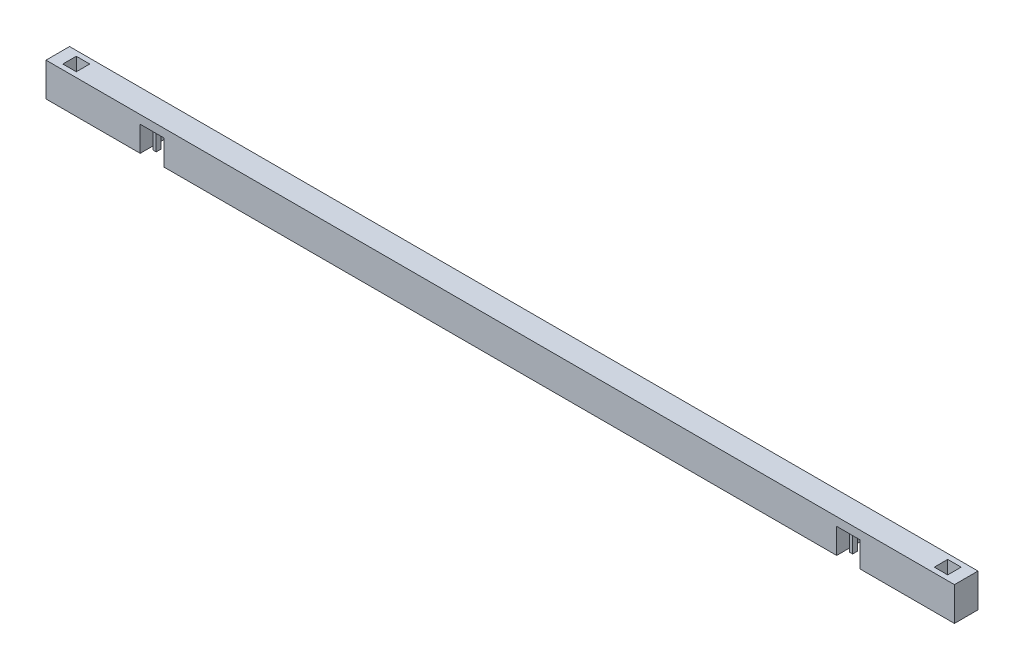
ISO-10303-21;
HEADER;
FILE_DESCRIPTION(('STEP AP214'),'2;1');
FILE_NAME('part.step','',(''),(''),'','','');
FILE_SCHEMA(('AUTOMOTIVE_DESIGN { 1 0 10303 214 1 1 1 1 }'));
ENDSEC;
DATA;
#1=APPLICATION_CONTEXT('core data for automotive mechanical design processes');
#2=APPLICATION_PROTOCOL_DEFINITION('international standard','automotive_design',2000,#1);
#3=PRODUCT_CONTEXT('',#1,'mechanical');
#4=PRODUCT('Part','Part','',(#3));
#5=PRODUCT_RELATED_PRODUCT_CATEGORY('part','',(#4));
#6=PRODUCT_DEFINITION_FORMATION('','',#4);
#7=PRODUCT_DEFINITION_CONTEXT('part definition',#1,'design');
#8=PRODUCT_DEFINITION('design','',#6,#7);
#9=PRODUCT_DEFINITION_SHAPE('','',#8);
#10=(LENGTH_UNIT() NAMED_UNIT(*) SI_UNIT(.MILLI.,.METRE.));
#11=(NAMED_UNIT(*) PLANE_ANGLE_UNIT() SI_UNIT($,.RADIAN.));
#12=(NAMED_UNIT(*) SI_UNIT($,.STERADIAN.) SOLID_ANGLE_UNIT());
#13=UNCERTAINTY_MEASURE_WITH_UNIT(LENGTH_MEASURE(1.E-05),#10,'distance_accuracy_value','');
#14=(GEOMETRIC_REPRESENTATION_CONTEXT(3) GLOBAL_UNCERTAINTY_ASSIGNED_CONTEXT((#13)) GLOBAL_UNIT_ASSIGNED_CONTEXT((#10,
#11,#12)) REPRESENTATION_CONTEXT('',''));
#15=CARTESIAN_POINT('',(0.,0.,0.));
#16=DIRECTION('',(0.,0.,1.));
#17=DIRECTION('',(1.,0.,0.));
#18=AXIS2_PLACEMENT_3D('',#15,#16,#17);
#19=CARTESIAN_POINT('',(0.,200.,0.));
#20=DIRECTION('',(0.,-1.,0.));
#21=DIRECTION('',(0.,0.,-1.));
#22=AXIS2_PLACEMENT_3D('',#19,#20,#21);
#23=PLANE('',#22);
#24=DIRECTION('',(0.,0.,1.));
#25=VECTOR('',#24,1.);
#26=CARTESIAN_POINT('',(0.,200.,0.));
#27=LINE('',#26,#25);
#28=CARTESIAN_POINT('',(0.,200.,-140.));
#29=VERTEX_POINT('',#28);
#30=CARTESIAN_POINT('',(0.,200.,0.));
#31=VERTEX_POINT('',#30);
#32=EDGE_CURVE('E516',#29,#31,#27,.T.);
#33=ORIENTED_EDGE('',*,*,#32,.T.);
#34=DIRECTION('',(1.,0.,0.));
#35=VECTOR('',#34,1.);
#36=CARTESIAN_POINT('',(0.,200.,0.));
#37=LINE('',#36,#35);
#38=CARTESIAN_POINT('',(5400.,200.,0.));
#39=VERTEX_POINT('',#38);
#40=EDGE_CURVE('E519',#31,#39,#37,.T.);
#41=ORIENTED_EDGE('',*,*,#40,.T.);
#42=DIRECTION('',(0.,0.,-1.));
#43=VECTOR('',#42,1.);
#44=CARTESIAN_POINT('',(5400.,200.,0.));
#45=LINE('',#44,#43);
#46=CARTESIAN_POINT('',(5400.,200.,-140.));
#47=VERTEX_POINT('',#46);
#48=EDGE_CURVE('E522',#39,#47,#45,.T.);
#49=ORIENTED_EDGE('',*,*,#48,.T.);
#50=DIRECTION('',(-1.,0.,0.));
#51=VECTOR('',#50,1.);
#52=CARTESIAN_POINT('',(0.,200.,-140.));
#53=LINE('',#52,#51);
#54=EDGE_CURVE('E524',#47,#29,#53,.T.);
#55=ORIENTED_EDGE('',*,*,#54,.T.);
#56=EDGE_LOOP('',(#33,#41,#49,#55));
#57=FACE_BOUND('',#56,.T.);
#58=DIRECTION('',(-1.,0.,0.));
#59=VECTOR('',#58,1.);
#60=CARTESIAN_POINT('',(5330.,200.,-110.));
#61=LINE('',#60,#59);
#62=CARTESIAN_POINT('',(5330.,200.,-110.));
#63=VERTEX_POINT('',#62);
#64=CARTESIAN_POINT('',(5250.,200.,-110.));
#65=VERTEX_POINT('',#64);
#66=EDGE_CURVE('E322',#63,#65,#61,.T.);
#67=ORIENTED_EDGE('',*,*,#66,.F.);
#68=DIRECTION('',(0.,0.,-1.));
#69=VECTOR('',#68,1.);
#70=CARTESIAN_POINT('',(5330.,200.,-110.));
#71=LINE('',#70,#69);
#72=CARTESIAN_POINT('',(5330.,200.,-30.));
#73=VERTEX_POINT('',#72);
#74=EDGE_CURVE('E59',#73,#63,#71,.T.);
#75=ORIENTED_EDGE('',*,*,#74,.F.);
#76=DIRECTION('',(1.,0.,0.));
#77=VECTOR('',#76,1.);
#78=CARTESIAN_POINT('',(5330.,200.,-30.));
#79=LINE('',#78,#77);
#80=CARTESIAN_POINT('',(5250.,200.,-30.));
#81=VERTEX_POINT('',#80);
#82=EDGE_CURVE('E311',#81,#73,#79,.T.);
#83=ORIENTED_EDGE('',*,*,#82,.F.);
#84=DIRECTION('',(0.,0.,1.));
#85=VECTOR('',#84,1.);
#86=CARTESIAN_POINT('',(5250.,200.,-110.));
#87=LINE('',#86,#85);
#88=EDGE_CURVE('E325',#65,#81,#87,.T.);
#89=ORIENTED_EDGE('',*,*,#88,.F.);
#90=EDGE_LOOP('',(#67,#75,#83,#89));
#91=FACE_BOUND('',#90,.T.);
#92=DIRECTION('',(0.,0.,-1.));
#93=VECTOR('',#92,1.);
#94=CARTESIAN_POINT('',(70.0000000000003,200.,-110.));
#95=LINE('',#94,#93);
#96=CARTESIAN_POINT('',(70.0000000000003,200.,-30.));
#97=VERTEX_POINT('',#96);
#98=CARTESIAN_POINT('',(70.0000000000003,200.,-110.));
#99=VERTEX_POINT('',#98);
#100=EDGE_CURVE('E51',#97,#99,#95,.T.);
#101=ORIENTED_EDGE('',*,*,#100,.T.);
#102=DIRECTION('',(1.,0.,0.));
#103=VECTOR('',#102,1.);
#104=CARTESIAN_POINT('',(70.0000000000003,200.,-110.));
#105=LINE('',#104,#103);
#106=CARTESIAN_POINT('',(150.,200.,-110.));
#107=VERTEX_POINT('',#106);
#108=EDGE_CURVE('E289',#99,#107,#105,.T.);
#109=ORIENTED_EDGE('',*,*,#108,.T.);
#110=DIRECTION('',(0.,0.,1.));
#111=VECTOR('',#110,1.);
#112=CARTESIAN_POINT('',(150.,200.,-110.));
#113=LINE('',#112,#111);
#114=CARTESIAN_POINT('',(150.,200.,-30.));
#115=VERTEX_POINT('',#114);
#116=EDGE_CURVE('E292',#107,#115,#113,.T.);
#117=ORIENTED_EDGE('',*,*,#116,.T.);
#118=DIRECTION('',(-1.,0.,0.));
#119=VECTOR('',#118,1.);
#120=CARTESIAN_POINT('',(70.0000000000003,200.,-30.));
#121=LINE('',#120,#119);
#122=EDGE_CURVE('E298',#115,#97,#121,.T.);
#123=ORIENTED_EDGE('',*,*,#122,.T.);
#124=EDGE_LOOP('',(#101,#109,#117,#123));
#125=FACE_BOUND('',#124,.T.);
#126=ADVANCED_FACE('F36',(#57,#91,#125),#23,.F.);
#127=CARTESIAN_POINT('',(0.,0.,0.));
#128=DIRECTION('',(0.,-1.,0.));
#129=DIRECTION('',(0.,0.,-1.));
#130=AXIS2_PLACEMENT_3D('',#127,#128,#129);
#131=PLANE('',#130);
#132=DIRECTION('',(0.,0.,-1.));
#133=VECTOR('',#132,1.);
#134=CARTESIAN_POINT('',(4700.,0.,-140.));
#135=LINE('',#134,#133);
#136=CARTESIAN_POINT('',(4700.,0.,0.));
#137=VERTEX_POINT('',#136);
#138=CARTESIAN_POINT('',(4700.,0.,-140.));
#139=VERTEX_POINT('',#138);
#140=EDGE_CURVE('E397',#137,#139,#135,.T.);
#141=ORIENTED_EDGE('',*,*,#140,.F.);
#142=DIRECTION('',(1.,0.,0.));
#143=VECTOR('',#142,1.);
#144=CARTESIAN_POINT('',(0.,0.,0.));
#145=LINE('',#144,#143);
#146=CARTESIAN_POINT('',(700.,0.,0.));
#147=VERTEX_POINT('',#146);
#148=EDGE_CURVE('E534',#147,#137,#145,.T.);
#149=ORIENTED_EDGE('',*,*,#148,.F.);
#150=DIRECTION('',(0.,0.,1.));
#151=VECTOR('',#150,1.);
#152=CARTESIAN_POINT('',(700.,0.,-140.));
#153=LINE('',#152,#151);
#154=CARTESIAN_POINT('',(700.,0.,-140.));
#155=VERTEX_POINT('',#154);
#156=EDGE_CURVE('E477',#155,#147,#153,.T.);
#157=ORIENTED_EDGE('',*,*,#156,.F.);
#158=DIRECTION('',(-1.,0.,0.));
#159=VECTOR('',#158,1.);
#160=CARTESIAN_POINT('',(0.,0.,-140.));
#161=LINE('',#160,#159);
#162=EDGE_CURVE('E539',#139,#155,#161,.T.);
#163=ORIENTED_EDGE('',*,*,#162,.F.);
#164=EDGE_LOOP('',(#141,#149,#157,#163));
#165=FACE_BOUND('',#164,.T.);
#166=ADVANCED_FACE('F579',(#165),#131,.T.);
#167=DIRECTION('',(0.,0.,-1.));
#168=VECTOR('',#167,1.);
#169=CARTESIAN_POINT('',(560.,0.,-140.));
#170=LINE('',#169,#168);
#171=CARTESIAN_POINT('',(560.,0.,0.));
#172=VERTEX_POINT('',#171);
#173=CARTESIAN_POINT('',(560.,0.,-140.));
#174=VERTEX_POINT('',#173);
#175=EDGE_CURVE('E473',#172,#174,#170,.T.);
#176=ORIENTED_EDGE('',*,*,#175,.F.);
#177=CARTESIAN_POINT('',(0.,0.,0.));
#178=VERTEX_POINT('',#177);
#179=EDGE_CURVE('E530',#178,#172,#145,.T.);
#180=ORIENTED_EDGE('',*,*,#179,.F.);
#181=DIRECTION('',(0.,0.,1.));
#182=VECTOR('',#181,1.);
#183=CARTESIAN_POINT('',(0.,0.,0.));
#184=LINE('',#183,#182);
#185=CARTESIAN_POINT('',(0.,0.,-140.));
#186=VERTEX_POINT('',#185);
#187=EDGE_CURVE('E515',#186,#178,#184,.T.);
#188=ORIENTED_EDGE('',*,*,#187,.F.);
#189=EDGE_CURVE('E536',#174,#186,#161,.T.);
#190=ORIENTED_EDGE('',*,*,#189,.F.);
#191=EDGE_LOOP('',(#176,#180,#188,#190));
#192=FACE_BOUND('',#191,.T.);
#193=ADVANCED_FACE('F561',(#192),#131,.T.);
#194=DIRECTION('',(0.,0.,1.));
#195=VECTOR('',#194,1.);
#196=CARTESIAN_POINT('',(4840.,0.,-140.));
#197=LINE('',#196,#195);
#198=CARTESIAN_POINT('',(4840.,0.,-140.));
#199=VERTEX_POINT('',#198);
#200=CARTESIAN_POINT('',(4840.,0.,0.));
#201=VERTEX_POINT('',#200);
#202=EDGE_CURVE('E407',#199,#201,#197,.T.);
#203=ORIENTED_EDGE('',*,*,#202,.F.);
#204=CARTESIAN_POINT('',(5400.,0.,-140.));
#205=VERTEX_POINT('',#204);
#206=EDGE_CURVE('E520',#205,#199,#161,.T.);
#207=ORIENTED_EDGE('',*,*,#206,.F.);
#208=DIRECTION('',(0.,0.,-1.));
#209=VECTOR('',#208,1.);
#210=CARTESIAN_POINT('',(5400.,0.,0.));
#211=LINE('',#210,#209);
#212=CARTESIAN_POINT('',(5400.,0.,0.));
#213=VERTEX_POINT('',#212);
#214=EDGE_CURVE('E533',#213,#205,#211,.T.);
#215=ORIENTED_EDGE('',*,*,#214,.F.);
#216=EDGE_CURVE('E529',#201,#213,#145,.T.);
#217=ORIENTED_EDGE('',*,*,#216,.F.);
#218=EDGE_LOOP('',(#203,#207,#215,#217));
#219=FACE_BOUND('',#218,.T.);
#220=ADVANCED_FACE('F591',(#219),#131,.T.);
#221=CARTESIAN_POINT('',(0.,200.,0.));
#222=DIRECTION('',(1.,0.,0.));
#223=DIRECTION('',(0.,0.,-1.));
#224=AXIS2_PLACEMENT_3D('',#221,#222,#223);
#225=PLANE('',#224);
#226=ORIENTED_EDGE('',*,*,#187,.T.);
#227=DIRECTION('',(0.,-1.,0.));
#228=VECTOR('',#227,1.);
#229=CARTESIAN_POINT('',(0.,200.,0.));
#230=LINE('',#229,#228);
#231=EDGE_CURVE('E44',#31,#178,#230,.T.);
#232=ORIENTED_EDGE('',*,*,#231,.F.);
#233=ORIENTED_EDGE('',*,*,#32,.F.);
#234=DIRECTION('',(0.,-1.,0.));
#235=VECTOR('',#234,1.);
#236=CARTESIAN_POINT('',(0.,200.,-140.));
#237=LINE('',#236,#235);
#238=EDGE_CURVE('E526',#29,#186,#237,.T.);
#239=ORIENTED_EDGE('',*,*,#238,.T.);
#240=EDGE_LOOP('',(#226,#232,#233,#239));
#241=FACE_BOUND('',#240,.T.);
#242=ADVANCED_FACE('F38',(#241),#225,.F.);
#243=CARTESIAN_POINT('',(0.,200.,0.));
#244=DIRECTION('',(0.,0.,-1.));
#245=DIRECTION('',(-1.,0.,0.));
#246=AXIS2_PLACEMENT_3D('',#243,#244,#245);
#247=PLANE('',#246);
#248=ORIENTED_EDGE('',*,*,#148,.T.);
#249=DIRECTION('',(0.,-1.,0.));
#250=VECTOR('',#249,1.);
#251=CARTESIAN_POINT('',(4700.,150.,0.));
#252=LINE('',#251,#250);
#253=CARTESIAN_POINT('',(4700.,150.,0.));
#254=VERTEX_POINT('',#253);
#255=EDGE_CURVE('E419',#254,#137,#252,.T.);
#256=ORIENTED_EDGE('',*,*,#255,.F.);
#257=DIRECTION('',(-1.,0.,0.));
#258=VECTOR('',#257,1.);
#259=CARTESIAN_POINT('',(4700.,150.,0.));
#260=LINE('',#259,#258);
#261=CARTESIAN_POINT('',(4840.,150.,0.));
#262=VERTEX_POINT('',#261);
#263=EDGE_CURVE('E413',#262,#254,#260,.T.);
#264=ORIENTED_EDGE('',*,*,#263,.F.);
#265=DIRECTION('',(0.,-1.,0.));
#266=VECTOR('',#265,1.);
#267=CARTESIAN_POINT('',(4840.,150.,0.));
#268=LINE('',#267,#266);
#269=EDGE_CURVE('E422',#262,#201,#268,.T.);
#270=ORIENTED_EDGE('',*,*,#269,.T.);
#271=ORIENTED_EDGE('',*,*,#216,.T.);
#272=DIRECTION('',(0.,-1.,0.));
#273=VECTOR('',#272,1.);
#274=CARTESIAN_POINT('',(5400.,200.,0.));
#275=LINE('',#274,#273);
#276=EDGE_CURVE('E545',#39,#213,#275,.T.);
#277=ORIENTED_EDGE('',*,*,#276,.F.);
#278=ORIENTED_EDGE('',*,*,#40,.F.);
#279=ORIENTED_EDGE('',*,*,#231,.T.);
#280=ORIENTED_EDGE('',*,*,#179,.T.);
#281=DIRECTION('',(0.,-1.,0.));
#282=VECTOR('',#281,1.);
#283=CARTESIAN_POINT('',(560.,150.,0.));
#284=LINE('',#283,#282);
#285=CARTESIAN_POINT('',(560.,150.,0.));
#286=VERTEX_POINT('',#285);
#287=EDGE_CURVE('E489',#286,#172,#284,.T.);
#288=ORIENTED_EDGE('',*,*,#287,.F.);
#289=DIRECTION('',(-1.,0.,0.));
#290=VECTOR('',#289,1.);
#291=CARTESIAN_POINT('',(560.,150.,0.));
#292=LINE('',#291,#290);
#293=CARTESIAN_POINT('',(700.,150.,0.));
#294=VERTEX_POINT('',#293);
#295=EDGE_CURVE('E483',#294,#286,#292,.T.);
#296=ORIENTED_EDGE('',*,*,#295,.F.);
#297=DIRECTION('',(0.,-1.,0.));
#298=VECTOR('',#297,1.);
#299=CARTESIAN_POINT('',(700.,150.,0.));
#300=LINE('',#299,#298);
#301=EDGE_CURVE('E492',#294,#147,#300,.T.);
#302=ORIENTED_EDGE('',*,*,#301,.T.);
#303=EDGE_LOOP('',(#248,#256,#264,#270,#271,#277,#278,#279,#280,#288,#296,#302));
#304=FACE_BOUND('',#303,.T.);
#305=ADVANCED_FACE('F551',(#304),#247,.F.);
#306=CARTESIAN_POINT('',(5400.,200.,0.));
#307=DIRECTION('',(-1.,0.,0.));
#308=DIRECTION('',(0.,0.,1.));
#309=AXIS2_PLACEMENT_3D('',#306,#307,#308);
#310=PLANE('',#309);
#311=ORIENTED_EDGE('',*,*,#214,.T.);
#312=DIRECTION('',(0.,-1.,0.));
#313=VECTOR('',#312,1.);
#314=CARTESIAN_POINT('',(5400.,200.,-140.));
#315=LINE('',#314,#313);
#316=EDGE_CURVE('E542',#47,#205,#315,.T.);
#317=ORIENTED_EDGE('',*,*,#316,.F.);
#318=ORIENTED_EDGE('',*,*,#48,.F.);
#319=ORIENTED_EDGE('',*,*,#276,.T.);
#320=EDGE_LOOP('',(#311,#317,#318,#319));
#321=FACE_BOUND('',#320,.T.);
#322=ADVANCED_FACE('F588',(#321),#310,.F.);
#323=CARTESIAN_POINT('',(0.,200.,-140.));
#324=DIRECTION('',(0.,0.,1.));
#325=DIRECTION('',(1.,0.,0.));
#326=AXIS2_PLACEMENT_3D('',#323,#324,#325);
#327=PLANE('',#326);
#328=DIRECTION('',(1.,0.,0.));
#329=VECTOR('',#328,1.);
#330=CARTESIAN_POINT('',(4700.,150.,-140.));
#331=LINE('',#330,#329);
#332=CARTESIAN_POINT('',(4700.,150.,-140.));
#333=VERTEX_POINT('',#332);
#334=CARTESIAN_POINT('',(4840.,150.,-140.));
#335=VERTEX_POINT('',#334);
#336=EDGE_CURVE('E406',#333,#335,#331,.T.);
#337=ORIENTED_EDGE('',*,*,#336,.F.);
#338=DIRECTION('',(0.,-1.,0.));
#339=VECTOR('',#338,1.);
#340=CARTESIAN_POINT('',(4700.,150.,-140.));
#341=LINE('',#340,#339);
#342=EDGE_CURVE('E416',#333,#139,#341,.T.);
#343=ORIENTED_EDGE('',*,*,#342,.T.);
#344=ORIENTED_EDGE('',*,*,#162,.T.);
#345=DIRECTION('',(0.,-1.,0.));
#346=VECTOR('',#345,1.);
#347=CARTESIAN_POINT('',(700.,150.,-140.));
#348=LINE('',#347,#346);
#349=CARTESIAN_POINT('',(700.,150.,-140.));
#350=VERTEX_POINT('',#349);
#351=EDGE_CURVE('E495',#350,#155,#348,.T.);
#352=ORIENTED_EDGE('',*,*,#351,.F.);
#353=DIRECTION('',(1.,0.,0.));
#354=VECTOR('',#353,1.);
#355=CARTESIAN_POINT('',(560.,150.,-140.));
#356=LINE('',#355,#354);
#357=CARTESIAN_POINT('',(560.,150.,-140.));
#358=VERTEX_POINT('',#357);
#359=EDGE_CURVE('E476',#358,#350,#356,.T.);
#360=ORIENTED_EDGE('',*,*,#359,.F.);
#361=DIRECTION('',(0.,-1.,0.));
#362=VECTOR('',#361,1.);
#363=CARTESIAN_POINT('',(560.,150.,-140.));
#364=LINE('',#363,#362);
#365=EDGE_CURVE('E486',#358,#174,#364,.T.);
#366=ORIENTED_EDGE('',*,*,#365,.T.);
#367=ORIENTED_EDGE('',*,*,#189,.T.);
#368=ORIENTED_EDGE('',*,*,#238,.F.);
#369=ORIENTED_EDGE('',*,*,#54,.F.);
#370=ORIENTED_EDGE('',*,*,#316,.T.);
#371=ORIENTED_EDGE('',*,*,#206,.T.);
#372=DIRECTION('',(0.,-1.,0.));
#373=VECTOR('',#372,1.);
#374=CARTESIAN_POINT('',(4840.,150.,-140.));
#375=LINE('',#374,#373);
#376=EDGE_CURVE('E425',#335,#199,#375,.T.);
#377=ORIENTED_EDGE('',*,*,#376,.F.);
#378=EDGE_LOOP('',(#337,#343,#344,#352,#360,#366,#367,#368,#369,#370,#371,#377));
#379=FACE_BOUND('',#378,.T.);
#380=ADVANCED_FACE('F568',(#379),#327,.F.);
#381=CARTESIAN_POINT('',(560.,150.,-140.));
#382=DIRECTION('',(-1.,0.,0.));
#383=DIRECTION('',(0.,0.,1.));
#384=AXIS2_PLACEMENT_3D('',#381,#382,#383);
#385=PLANE('',#384);
#386=ORIENTED_EDGE('',*,*,#175,.T.);
#387=ORIENTED_EDGE('',*,*,#365,.F.);
#388=DIRECTION('',(0.,0.,-1.));
#389=VECTOR('',#388,1.);
#390=CARTESIAN_POINT('',(560.,150.,-140.));
#391=LINE('',#390,#389);
#392=EDGE_CURVE('E474',#286,#358,#391,.T.);
#393=ORIENTED_EDGE('',*,*,#392,.F.);
#394=ORIENTED_EDGE('',*,*,#287,.T.);
#395=EDGE_LOOP('',(#386,#387,#393,#394));
#396=FACE_BOUND('',#395,.T.);
#397=ADVANCED_FACE('F564',(#396),#385,.F.);
#398=CARTESIAN_POINT('',(700.,150.,-140.));
#399=DIRECTION('',(1.,0.,0.));
#400=DIRECTION('',(0.,0.,-1.));
#401=AXIS2_PLACEMENT_3D('',#398,#399,#400);
#402=PLANE('',#401);
#403=ORIENTED_EDGE('',*,*,#156,.T.);
#404=ORIENTED_EDGE('',*,*,#301,.F.);
#405=DIRECTION('',(0.,0.,1.));
#406=VECTOR('',#405,1.);
#407=CARTESIAN_POINT('',(700.,150.,-140.));
#408=LINE('',#407,#406);
#409=EDGE_CURVE('E480',#350,#294,#408,.T.);
#410=ORIENTED_EDGE('',*,*,#409,.F.);
#411=ORIENTED_EDGE('',*,*,#351,.T.);
#412=EDGE_LOOP('',(#403,#404,#410,#411));
#413=FACE_BOUND('',#412,.T.);
#414=ADVANCED_FACE('F692',(#413),#402,.F.);
#415=CARTESIAN_POINT('',(0.,150.,0.));
#416=DIRECTION('',(0.,1.,0.));
#417=DIRECTION('',(0.,0.,1.));
#418=AXIS2_PLACEMENT_3D('',#415,#416,#417);
#419=PLANE('',#418);
#420=DIRECTION('',(1.,0.,0.));
#421=VECTOR('',#420,1.);
#422=CARTESIAN_POINT('',(660.,150.,-85.));
#423=LINE('',#422,#421);
#424=CARTESIAN_POINT('',(660.,150.,-85.));
#425=VERTEX_POINT('',#424);
#426=CARTESIAN_POINT('',(680.,150.,-85.));
#427=VERTEX_POINT('',#426);
#428=EDGE_CURVE('E449',#425,#427,#423,.T.);
#429=ORIENTED_EDGE('',*,*,#428,.F.);
#430=DIRECTION('',(0.,0.,-1.));
#431=VECTOR('',#430,1.);
#432=CARTESIAN_POINT('',(660.,150.,-55.));
#433=LINE('',#432,#431);
#434=CARTESIAN_POINT('',(660.,150.,-55.));
#435=VERTEX_POINT('',#434);
#436=EDGE_CURVE('E458',#435,#425,#433,.T.);
#437=ORIENTED_EDGE('',*,*,#436,.F.);
#438=DIRECTION('',(-1.,0.,0.));
#439=VECTOR('',#438,1.);
#440=CARTESIAN_POINT('',(680.,150.,-55.));
#441=LINE('',#440,#439);
#442=CARTESIAN_POINT('',(680.,150.,-55.));
#443=VERTEX_POINT('',#442);
#444=EDGE_CURVE('E455',#443,#435,#441,.T.);
#445=ORIENTED_EDGE('',*,*,#444,.F.);
#446=DIRECTION('',(0.,0.,1.));
#447=VECTOR('',#446,1.);
#448=CARTESIAN_POINT('',(680.,150.,-85.));
#449=LINE('',#448,#447);
#450=EDGE_CURVE('E452',#427,#443,#449,.T.);
#451=ORIENTED_EDGE('',*,*,#450,.F.);
#452=EDGE_LOOP('',(#429,#437,#445,#451));
#453=FACE_BOUND('',#452,.T.);
#454=DIRECTION('',(0.,0.,-1.));
#455=VECTOR('',#454,1.);
#456=CARTESIAN_POINT('',(580.,150.,-55.));
#457=LINE('',#456,#455);
#458=CARTESIAN_POINT('',(580.,150.,-55.));
#459=VERTEX_POINT('',#458);
#460=CARTESIAN_POINT('',(580.,150.,-85.));
#461=VERTEX_POINT('',#460);
#462=EDGE_CURVE('E461',#459,#461,#457,.T.);
#463=ORIENTED_EDGE('',*,*,#462,.F.);
#464=DIRECTION('',(-1.,0.,0.));
#465=VECTOR('',#464,1.);
#466=CARTESIAN_POINT('',(600.,150.,-55.));
#467=LINE('',#466,#465);
#468=CARTESIAN_POINT('',(600.,150.,-55.));
#469=VERTEX_POINT('',#468);
#470=EDGE_CURVE('E470',#469,#459,#467,.T.);
#471=ORIENTED_EDGE('',*,*,#470,.F.);
#472=DIRECTION('',(0.,0.,1.));
#473=VECTOR('',#472,1.);
#474=CARTESIAN_POINT('',(600.,150.,-85.));
#475=LINE('',#474,#473);
#476=CARTESIAN_POINT('',(600.,150.,-85.));
#477=VERTEX_POINT('',#476);
#478=EDGE_CURVE('E467',#477,#469,#475,.T.);
#479=ORIENTED_EDGE('',*,*,#478,.F.);
#480=DIRECTION('',(1.,0.,0.));
#481=VECTOR('',#480,1.);
#482=CARTESIAN_POINT('',(580.,150.,-85.));
#483=LINE('',#482,#481);
#484=EDGE_CURVE('E464',#461,#477,#483,.T.);
#485=ORIENTED_EDGE('',*,*,#484,.F.);
#486=EDGE_LOOP('',(#463,#471,#479,#485));
#487=FACE_BOUND('',#486,.T.);
#488=ORIENTED_EDGE('',*,*,#392,.T.);
#489=ORIENTED_EDGE('',*,*,#359,.T.);
#490=ORIENTED_EDGE('',*,*,#409,.T.);
#491=ORIENTED_EDGE('',*,*,#295,.T.);
#492=EDGE_LOOP('',(#488,#489,#490,#491));
#493=FACE_BOUND('',#492,.T.);
#494=ADVANCED_FACE('F571',(#453,#487,#493),#419,.F.);
#495=CARTESIAN_POINT('',(580.,-150.,-55.));
#496=DIRECTION('',(0.,0.,-1.));
#497=DIRECTION('',(-1.,0.,0.));
#498=AXIS2_PLACEMENT_3D('',#495,#496,#497);
#499=PLANE('',#498);
#500=DIRECTION('',(0.,1.,0.));
#501=VECTOR('',#500,1.);
#502=CARTESIAN_POINT('',(580.,-150.,-55.));
#503=LINE('',#502,#501);
#504=CARTESIAN_POINT('',(580.,0.,-55.));
#505=VERTEX_POINT('',#504);
#506=EDGE_CURVE('E507',#505,#459,#503,.T.);
#507=ORIENTED_EDGE('',*,*,#506,.F.);
#508=DIRECTION('',(1.,0.,0.));
#509=VECTOR('',#508,1.);
#510=CARTESIAN_POINT('',(580.,0.,-55.));
#511=LINE('',#510,#509);
#512=CARTESIAN_POINT('',(600.,0.,-55.));
#513=VERTEX_POINT('',#512);
#514=EDGE_CURVE('E446',#505,#513,#511,.T.);
#515=ORIENTED_EDGE('',*,*,#514,.T.);
#516=DIRECTION('',(0.,1.,0.));
#517=VECTOR('',#516,1.);
#518=CARTESIAN_POINT('',(600.,-150.,-55.));
#519=LINE('',#518,#517);
#520=EDGE_CURVE('E509',#513,#469,#519,.T.);
#521=ORIENTED_EDGE('',*,*,#520,.T.);
#522=ORIENTED_EDGE('',*,*,#470,.T.);
#523=EDGE_LOOP('',(#507,#515,#521,#522));
#524=FACE_BOUND('',#523,.T.);
#525=ADVANCED_FACE('F691',(#524),#499,.F.);
#526=CARTESIAN_POINT('',(600.,-150.,-55.));
#527=DIRECTION('',(-1.,0.,0.));
#528=DIRECTION('',(0.,0.,1.));
#529=AXIS2_PLACEMENT_3D('',#526,#527,#528);
#530=PLANE('',#529);
#531=ORIENTED_EDGE('',*,*,#520,.F.);
#532=DIRECTION('',(0.,0.,-1.));
#533=VECTOR('',#532,1.);
#534=CARTESIAN_POINT('',(600.,0.,-55.));
#535=LINE('',#534,#533);
#536=CARTESIAN_POINT('',(600.,0.,-85.));
#537=VERTEX_POINT('',#536);
#538=EDGE_CURVE('E443',#513,#537,#535,.T.);
#539=ORIENTED_EDGE('',*,*,#538,.T.);
#540=DIRECTION('',(0.,1.,0.));
#541=VECTOR('',#540,1.);
#542=CARTESIAN_POINT('',(600.,-150.,-85.));
#543=LINE('',#542,#541);
#544=EDGE_CURVE('E511',#537,#477,#543,.T.);
#545=ORIENTED_EDGE('',*,*,#544,.T.);
#546=ORIENTED_EDGE('',*,*,#478,.T.);
#547=EDGE_LOOP('',(#531,#539,#545,#546));
#548=FACE_BOUND('',#547,.T.);
#549=ADVANCED_FACE('F717',(#548),#530,.F.);
#550=CARTESIAN_POINT('',(580.,-150.,-85.));
#551=DIRECTION('',(0.,0.,1.));
#552=DIRECTION('',(1.,0.,0.));
#553=AXIS2_PLACEMENT_3D('',#550,#551,#552);
#554=PLANE('',#553);
#555=ORIENTED_EDGE('',*,*,#544,.F.);
#556=DIRECTION('',(-1.,0.,0.));
#557=VECTOR('',#556,1.);
#558=CARTESIAN_POINT('',(580.,0.,-85.));
#559=LINE('',#558,#557);
#560=CARTESIAN_POINT('',(580.,0.,-85.));
#561=VERTEX_POINT('',#560);
#562=EDGE_CURVE('E440',#537,#561,#559,.T.);
#563=ORIENTED_EDGE('',*,*,#562,.T.);
#564=DIRECTION('',(0.,1.,0.));
#565=VECTOR('',#564,1.);
#566=CARTESIAN_POINT('',(580.,-150.,-85.));
#567=LINE('',#566,#565);
#568=EDGE_CURVE('E513',#561,#461,#567,.T.);
#569=ORIENTED_EDGE('',*,*,#568,.T.);
#570=ORIENTED_EDGE('',*,*,#484,.T.);
#571=EDGE_LOOP('',(#555,#563,#569,#570));
#572=FACE_BOUND('',#571,.T.);
#573=ADVANCED_FACE('F721',(#572),#554,.F.);
#574=CARTESIAN_POINT('',(580.,-150.,-55.));
#575=DIRECTION('',(1.,0.,0.));
#576=DIRECTION('',(0.,0.,-1.));
#577=AXIS2_PLACEMENT_3D('',#574,#575,#576);
#578=PLANE('',#577);
#579=ORIENTED_EDGE('',*,*,#568,.F.);
#580=DIRECTION('',(0.,0.,1.));
#581=VECTOR('',#580,1.);
#582=CARTESIAN_POINT('',(580.,0.,-55.));
#583=LINE('',#582,#581);
#584=EDGE_CURVE('E437',#561,#505,#583,.T.);
#585=ORIENTED_EDGE('',*,*,#584,.T.);
#586=ORIENTED_EDGE('',*,*,#506,.T.);
#587=ORIENTED_EDGE('',*,*,#462,.T.);
#588=EDGE_LOOP('',(#579,#585,#586,#587));
#589=FACE_BOUND('',#588,.T.);
#590=ADVANCED_FACE('F702',(#589),#578,.F.);
#591=CARTESIAN_POINT('',(660.,-150.,-55.));
#592=DIRECTION('',(0.,0.,-1.));
#593=DIRECTION('',(-1.,0.,0.));
#594=AXIS2_PLACEMENT_3D('',#591,#592,#593);
#595=PLANE('',#594);
#596=DIRECTION('',(0.,1.,0.));
#597=VECTOR('',#596,1.);
#598=CARTESIAN_POINT('',(660.,-150.,-55.));
#599=LINE('',#598,#597);
#600=CARTESIAN_POINT('',(660.,0.,-55.));
#601=VERTEX_POINT('',#600);
#602=EDGE_CURVE('E491',#601,#435,#599,.T.);
#603=ORIENTED_EDGE('',*,*,#602,.F.);
#604=DIRECTION('',(1.,0.,0.));
#605=VECTOR('',#604,1.);
#606=CARTESIAN_POINT('',(660.,0.,-55.));
#607=LINE('',#606,#605);
#608=CARTESIAN_POINT('',(680.,0.,-55.));
#609=VERTEX_POINT('',#608);
#610=EDGE_CURVE('E434',#601,#609,#607,.T.);
#611=ORIENTED_EDGE('',*,*,#610,.T.);
#612=DIRECTION('',(0.,1.,0.));
#613=VECTOR('',#612,1.);
#614=CARTESIAN_POINT('',(680.,-150.,-55.));
#615=LINE('',#614,#613);
#616=EDGE_CURVE('E501',#609,#443,#615,.T.);
#617=ORIENTED_EDGE('',*,*,#616,.T.);
#618=ORIENTED_EDGE('',*,*,#444,.T.);
#619=EDGE_LOOP('',(#603,#611,#617,#618));
#620=FACE_BOUND('',#619,.T.);
#621=ADVANCED_FACE('F698',(#620),#595,.F.);
#622=CARTESIAN_POINT('',(680.,-150.,-55.));
#623=DIRECTION('',(-1.,0.,0.));
#624=DIRECTION('',(0.,0.,1.));
#625=AXIS2_PLACEMENT_3D('',#622,#623,#624);
#626=PLANE('',#625);
#627=ORIENTED_EDGE('',*,*,#616,.F.);
#628=DIRECTION('',(0.,0.,-1.));
#629=VECTOR('',#628,1.);
#630=CARTESIAN_POINT('',(680.,0.,-55.));
#631=LINE('',#630,#629);
#632=CARTESIAN_POINT('',(680.,0.,-85.));
#633=VERTEX_POINT('',#632);
#634=EDGE_CURVE('E431',#609,#633,#631,.T.);
#635=ORIENTED_EDGE('',*,*,#634,.T.);
#636=DIRECTION('',(0.,1.,0.));
#637=VECTOR('',#636,1.);
#638=CARTESIAN_POINT('',(680.,-150.,-85.));
#639=LINE('',#638,#637);
#640=EDGE_CURVE('E503',#633,#427,#639,.T.);
#641=ORIENTED_EDGE('',*,*,#640,.T.);
#642=ORIENTED_EDGE('',*,*,#450,.T.);
#643=EDGE_LOOP('',(#627,#635,#641,#642));
#644=FACE_BOUND('',#643,.T.);
#645=ADVANCED_FACE('F701',(#644),#626,.F.);
#646=CARTESIAN_POINT('',(660.,-150.,-85.));
#647=DIRECTION('',(0.,0.,1.));
#648=DIRECTION('',(1.,0.,0.));
#649=AXIS2_PLACEMENT_3D('',#646,#647,#648);
#650=PLANE('',#649);
#651=ORIENTED_EDGE('',*,*,#640,.F.);
#652=DIRECTION('',(-1.,0.,0.));
#653=VECTOR('',#652,1.);
#654=CARTESIAN_POINT('',(660.,0.,-85.));
#655=LINE('',#654,#653);
#656=CARTESIAN_POINT('',(660.,0.,-85.));
#657=VERTEX_POINT('',#656);
#658=EDGE_CURVE('E421',#633,#657,#655,.T.);
#659=ORIENTED_EDGE('',*,*,#658,.T.);
#660=DIRECTION('',(0.,1.,0.));
#661=VECTOR('',#660,1.);
#662=CARTESIAN_POINT('',(660.,-150.,-85.));
#663=LINE('',#662,#661);
#664=EDGE_CURVE('E505',#657,#425,#663,.T.);
#665=ORIENTED_EDGE('',*,*,#664,.T.);
#666=ORIENTED_EDGE('',*,*,#428,.T.);
#667=EDGE_LOOP('',(#651,#659,#665,#666));
#668=FACE_BOUND('',#667,.T.);
#669=ADVANCED_FACE('F706',(#668),#650,.F.);
#670=CARTESIAN_POINT('',(660.,-150.,-55.));
#671=DIRECTION('',(1.,0.,0.));
#672=DIRECTION('',(0.,0.,-1.));
#673=AXIS2_PLACEMENT_3D('',#670,#671,#672);
#674=PLANE('',#673);
#675=ORIENTED_EDGE('',*,*,#664,.F.);
#676=DIRECTION('',(0.,0.,1.));
#677=VECTOR('',#676,1.);
#678=CARTESIAN_POINT('',(660.,0.,-55.));
#679=LINE('',#678,#677);
#680=EDGE_CURVE('E11',#657,#601,#679,.T.);
#681=ORIENTED_EDGE('',*,*,#680,.T.);
#682=ORIENTED_EDGE('',*,*,#602,.T.);
#683=ORIENTED_EDGE('',*,*,#436,.T.);
#684=EDGE_LOOP('',(#675,#681,#682,#683));
#685=FACE_BOUND('',#684,.T.);
#686=ADVANCED_FACE('F710',(#685),#674,.F.);
#687=CARTESIAN_POINT('',(860.,0.,0.));
#688=DIRECTION('',(0.,1.,0.));
#689=DIRECTION('',(0.,0.,1.));
#690=AXIS2_PLACEMENT_3D('',#687,#688,#689);
#691=PLANE('',#690);
#692=ORIENTED_EDGE('',*,*,#680,.F.);
#693=ORIENTED_EDGE('',*,*,#658,.F.);
#694=ORIENTED_EDGE('',*,*,#634,.F.);
#695=ORIENTED_EDGE('',*,*,#610,.F.);
#696=EDGE_LOOP('',(#692,#693,#694,#695));
#697=FACE_BOUND('',#696,.T.);
#698=ADVANCED_FACE('F687',(#697),#691,.F.);
#699=ORIENTED_EDGE('',*,*,#584,.F.);
#700=ORIENTED_EDGE('',*,*,#562,.F.);
#701=ORIENTED_EDGE('',*,*,#538,.F.);
#702=ORIENTED_EDGE('',*,*,#514,.F.);
#703=EDGE_LOOP('',(#699,#700,#701,#702));
#704=FACE_BOUND('',#703,.T.);
#705=ADVANCED_FACE('F683',(#704),#691,.F.);
#706=CARTESIAN_POINT('',(4700.,150.,-140.));
#707=DIRECTION('',(-1.,0.,0.));
#708=DIRECTION('',(0.,0.,1.));
#709=AXIS2_PLACEMENT_3D('',#706,#707,#708);
#710=PLANE('',#709);
#711=ORIENTED_EDGE('',*,*,#140,.T.);
#712=ORIENTED_EDGE('',*,*,#342,.F.);
#713=DIRECTION('',(0.,0.,-1.));
#714=VECTOR('',#713,1.);
#715=CARTESIAN_POINT('',(4700.,150.,-140.));
#716=LINE('',#715,#714);
#717=EDGE_CURVE('E404',#254,#333,#716,.T.);
#718=ORIENTED_EDGE('',*,*,#717,.F.);
#719=ORIENTED_EDGE('',*,*,#255,.T.);
#720=EDGE_LOOP('',(#711,#712,#718,#719));
#721=FACE_BOUND('',#720,.T.);
#722=ADVANCED_FACE('F679',(#721),#710,.F.);
#723=CARTESIAN_POINT('',(4840.,150.,-140.));
#724=DIRECTION('',(1.,0.,0.));
#725=DIRECTION('',(0.,0.,-1.));
#726=AXIS2_PLACEMENT_3D('',#723,#724,#725);
#727=PLANE('',#726);
#728=ORIENTED_EDGE('',*,*,#202,.T.);
#729=ORIENTED_EDGE('',*,*,#269,.F.);
#730=DIRECTION('',(0.,0.,1.));
#731=VECTOR('',#730,1.);
#732=CARTESIAN_POINT('',(4840.,150.,-140.));
#733=LINE('',#732,#731);
#734=EDGE_CURVE('E410',#335,#262,#733,.T.);
#735=ORIENTED_EDGE('',*,*,#734,.F.);
#736=ORIENTED_EDGE('',*,*,#376,.T.);
#737=EDGE_LOOP('',(#728,#729,#735,#736));
#738=FACE_BOUND('',#737,.T.);
#739=ADVANCED_FACE('F675',(#738),#727,.F.);
#740=CARTESIAN_POINT('',(4140.,150.,0.));
#741=DIRECTION('',(0.,1.,0.));
#742=DIRECTION('',(0.,0.,1.));
#743=AXIS2_PLACEMENT_3D('',#740,#741,#742);
#744=PLANE('',#743);
#745=DIRECTION('',(1.,0.,0.));
#746=VECTOR('',#745,1.);
#747=CARTESIAN_POINT('',(4800.,150.,-85.));
#748=LINE('',#747,#746);
#749=CARTESIAN_POINT('',(4800.,150.,-85.));
#750=VERTEX_POINT('',#749);
#751=CARTESIAN_POINT('',(4820.,150.,-85.));
#752=VERTEX_POINT('',#751);
#753=EDGE_CURVE('E338',#750,#752,#748,.T.);
#754=ORIENTED_EDGE('',*,*,#753,.F.);
#755=DIRECTION('',(0.,0.,-1.));
#756=VECTOR('',#755,1.);
#757=CARTESIAN_POINT('',(4800.,150.,-55.));
#758=LINE('',#757,#756);
#759=CARTESIAN_POINT('',(4800.,150.,-55.));
#760=VERTEX_POINT('',#759);
#761=EDGE_CURVE('E348',#760,#750,#758,.T.);
#762=ORIENTED_EDGE('',*,*,#761,.F.);
#763=DIRECTION('',(-1.,0.,0.));
#764=VECTOR('',#763,1.);
#765=CARTESIAN_POINT('',(4820.,150.,-55.));
#766=LINE('',#765,#764);
#767=CARTESIAN_POINT('',(4820.,150.,-55.));
#768=VERTEX_POINT('',#767);
#769=EDGE_CURVE('E345',#768,#760,#766,.T.);
#770=ORIENTED_EDGE('',*,*,#769,.F.);
#771=DIRECTION('',(0.,0.,1.));
#772=VECTOR('',#771,1.);
#773=CARTESIAN_POINT('',(4820.,150.,-85.));
#774=LINE('',#773,#772);
#775=EDGE_CURVE('E341',#752,#768,#774,.T.);
#776=ORIENTED_EDGE('',*,*,#775,.F.);
#777=EDGE_LOOP('',(#754,#762,#770,#776));
#778=FACE_BOUND('',#777,.T.);
#779=DIRECTION('',(0.,0.,-1.));
#780=VECTOR('',#779,1.);
#781=CARTESIAN_POINT('',(4720.,150.,-55.));
#782=LINE('',#781,#780);
#783=CARTESIAN_POINT('',(4720.,150.,-55.));
#784=VERTEX_POINT('',#783);
#785=CARTESIAN_POINT('',(4720.,150.,-85.));
#786=VERTEX_POINT('',#785);
#787=EDGE_CURVE('E371',#784,#786,#782,.T.);
#788=ORIENTED_EDGE('',*,*,#787,.F.);
#789=DIRECTION('',(-1.,0.,0.));
#790=VECTOR('',#789,1.);
#791=CARTESIAN_POINT('',(4740.,150.,-55.));
#792=LINE('',#791,#790);
#793=CARTESIAN_POINT('',(4740.,150.,-55.));
#794=VERTEX_POINT('',#793);
#795=EDGE_CURVE('E381',#794,#784,#792,.T.);
#796=ORIENTED_EDGE('',*,*,#795,.F.);
#797=DIRECTION('',(0.,0.,1.));
#798=VECTOR('',#797,1.);
#799=CARTESIAN_POINT('',(4740.,150.,-85.));
#800=LINE('',#799,#798);
#801=CARTESIAN_POINT('',(4740.,150.,-85.));
#802=VERTEX_POINT('',#801);
#803=EDGE_CURVE('E378',#802,#794,#800,.T.);
#804=ORIENTED_EDGE('',*,*,#803,.F.);
#805=DIRECTION('',(1.,0.,0.));
#806=VECTOR('',#805,1.);
#807=CARTESIAN_POINT('',(4720.,150.,-85.));
#808=LINE('',#807,#806);
#809=EDGE_CURVE('E374',#786,#802,#808,.T.);
#810=ORIENTED_EDGE('',*,*,#809,.F.);
#811=EDGE_LOOP('',(#788,#796,#804,#810));
#812=FACE_BOUND('',#811,.T.);
#813=ORIENTED_EDGE('',*,*,#717,.T.);
#814=ORIENTED_EDGE('',*,*,#336,.T.);
#815=ORIENTED_EDGE('',*,*,#734,.T.);
#816=ORIENTED_EDGE('',*,*,#263,.T.);
#817=EDGE_LOOP('',(#813,#814,#815,#816));
#818=FACE_BOUND('',#817,.T.);
#819=ADVANCED_FACE('F671',(#778,#812,#818),#744,.F.);
#820=CARTESIAN_POINT('',(4720.,150.,-55.));
#821=DIRECTION('',(-1.,0.,0.));
#822=DIRECTION('',(0.,0.,1.));
#823=AXIS2_PLACEMENT_3D('',#820,#821,#822);
#824=PLANE('',#823);
#825=DIRECTION('',(0.,0.,-1.));
#826=VECTOR('',#825,1.);
#827=CARTESIAN_POINT('',(4720.,0.,-55.));
#828=LINE('',#827,#826);
#829=CARTESIAN_POINT('',(4720.,0.,-55.));
#830=VERTEX_POINT('',#829);
#831=CARTESIAN_POINT('',(4720.,0.,-85.));
#832=VERTEX_POINT('',#831);
#833=EDGE_CURVE('E364',#830,#832,#828,.T.);
#834=ORIENTED_EDGE('',*,*,#833,.F.);
#835=DIRECTION('',(0.,-1.,0.));
#836=VECTOR('',#835,1.);
#837=CARTESIAN_POINT('',(4720.,150.,-55.));
#838=LINE('',#837,#836);
#839=EDGE_CURVE('E395',#784,#830,#838,.T.);
#840=ORIENTED_EDGE('',*,*,#839,.F.);
#841=ORIENTED_EDGE('',*,*,#787,.T.);
#842=DIRECTION('',(0.,-1.,0.));
#843=VECTOR('',#842,1.);
#844=CARTESIAN_POINT('',(4720.,150.,-85.));
#845=LINE('',#844,#843);
#846=EDGE_CURVE('E384',#786,#832,#845,.T.);
#847=ORIENTED_EDGE('',*,*,#846,.T.);
#848=EDGE_LOOP('',(#834,#840,#841,#847));
#849=FACE_BOUND('',#848,.T.);
#850=ADVANCED_FACE('F661',(#849),#824,.T.);
#851=CARTESIAN_POINT('',(4740.,150.,-55.));
#852=DIRECTION('',(0.,0.,1.));
#853=DIRECTION('',(1.,0.,0.));
#854=AXIS2_PLACEMENT_3D('',#851,#852,#853);
#855=PLANE('',#854);
#856=DIRECTION('',(-1.,0.,0.));
#857=VECTOR('',#856,1.);
#858=CARTESIAN_POINT('',(4740.,0.,-55.));
#859=LINE('',#858,#857);
#860=CARTESIAN_POINT('',(4740.,0.,-55.));
#861=VERTEX_POINT('',#860);
#862=EDGE_CURVE('E375',#861,#830,#859,.T.);
#863=ORIENTED_EDGE('',*,*,#862,.F.);
#864=DIRECTION('',(0.,-1.,0.));
#865=VECTOR('',#864,1.);
#866=CARTESIAN_POINT('',(4740.,150.,-55.));
#867=LINE('',#866,#865);
#868=EDGE_CURVE('E398',#794,#861,#867,.T.);
#869=ORIENTED_EDGE('',*,*,#868,.F.);
#870=ORIENTED_EDGE('',*,*,#795,.T.);
#871=ORIENTED_EDGE('',*,*,#839,.T.);
#872=EDGE_LOOP('',(#863,#869,#870,#871));
#873=FACE_BOUND('',#872,.T.);
#874=ADVANCED_FACE('F657',(#873),#855,.T.);
#875=CARTESIAN_POINT('',(4740.,150.,-85.));
#876=DIRECTION('',(1.,0.,0.));
#877=DIRECTION('',(0.,0.,-1.));
#878=AXIS2_PLACEMENT_3D('',#875,#876,#877);
#879=PLANE('',#878);
#880=DIRECTION('',(0.,0.,1.));
#881=VECTOR('',#880,1.);
#882=CARTESIAN_POINT('',(4740.,0.,-85.));
#883=LINE('',#882,#881);
#884=CARTESIAN_POINT('',(4740.,0.,-85.));
#885=VERTEX_POINT('',#884);
#886=EDGE_CURVE('E390',#885,#861,#883,.T.);
#887=ORIENTED_EDGE('',*,*,#886,.F.);
#888=DIRECTION('',(0.,-1.,0.));
#889=VECTOR('',#888,1.);
#890=CARTESIAN_POINT('',(4740.,150.,-85.));
#891=LINE('',#890,#889);
#892=EDGE_CURVE('E400',#802,#885,#891,.T.);
#893=ORIENTED_EDGE('',*,*,#892,.F.);
#894=ORIENTED_EDGE('',*,*,#803,.T.);
#895=ORIENTED_EDGE('',*,*,#868,.T.);
#896=EDGE_LOOP('',(#887,#893,#894,#895));
#897=FACE_BOUND('',#896,.T.);
#898=ADVANCED_FACE('F660',(#897),#879,.T.);
#899=CARTESIAN_POINT('',(4720.,150.,-85.));
#900=DIRECTION('',(0.,0.,-1.));
#901=DIRECTION('',(-1.,0.,0.));
#902=AXIS2_PLACEMENT_3D('',#899,#900,#901);
#903=PLANE('',#902);
#904=DIRECTION('',(1.,0.,0.));
#905=VECTOR('',#904,1.);
#906=CARTESIAN_POINT('',(4720.,0.,-85.));
#907=LINE('',#906,#905);
#908=EDGE_CURVE('E387',#832,#885,#907,.T.);
#909=ORIENTED_EDGE('',*,*,#908,.F.);
#910=ORIENTED_EDGE('',*,*,#846,.F.);
#911=ORIENTED_EDGE('',*,*,#809,.T.);
#912=ORIENTED_EDGE('',*,*,#892,.T.);
#913=EDGE_LOOP('',(#909,#910,#911,#912));
#914=FACE_BOUND('',#913,.T.);
#915=ADVANCED_FACE('F655',(#914),#903,.T.);
#916=CARTESIAN_POINT('',(4800.,150.,-85.));
#917=DIRECTION('',(0.,0.,-1.));
#918=DIRECTION('',(-1.,0.,0.));
#919=AXIS2_PLACEMENT_3D('',#916,#917,#918);
#920=PLANE('',#919);
#921=DIRECTION('',(1.,0.,0.));
#922=VECTOR('',#921,1.);
#923=CARTESIAN_POINT('',(4800.,0.,-85.));
#924=LINE('',#923,#922);
#925=CARTESIAN_POINT('',(4800.,0.,-85.));
#926=VERTEX_POINT('',#925);
#927=CARTESIAN_POINT('',(4820.,0.,-85.));
#928=VERTEX_POINT('',#927);
#929=EDGE_CURVE('E332',#926,#928,#924,.T.);
#930=ORIENTED_EDGE('',*,*,#929,.F.);
#931=DIRECTION('',(0.,-1.,0.));
#932=VECTOR('',#931,1.);
#933=CARTESIAN_POINT('',(4800.,150.,-85.));
#934=LINE('',#933,#932);
#935=EDGE_CURVE('E362',#750,#926,#934,.T.);
#936=ORIENTED_EDGE('',*,*,#935,.F.);
#937=ORIENTED_EDGE('',*,*,#753,.T.);
#938=DIRECTION('',(0.,-1.,0.));
#939=VECTOR('',#938,1.);
#940=CARTESIAN_POINT('',(4820.,150.,-85.));
#941=LINE('',#940,#939);
#942=EDGE_CURVE('E351',#752,#928,#941,.T.);
#943=ORIENTED_EDGE('',*,*,#942,.T.);
#944=EDGE_LOOP('',(#930,#936,#937,#943));
#945=FACE_BOUND('',#944,.T.);
#946=ADVANCED_FACE('F643',(#945),#920,.T.);
#947=CARTESIAN_POINT('',(4800.,150.,-55.));
#948=DIRECTION('',(-1.,0.,0.));
#949=DIRECTION('',(0.,0.,1.));
#950=AXIS2_PLACEMENT_3D('',#947,#948,#949);
#951=PLANE('',#950);
#952=DIRECTION('',(0.,0.,-1.));
#953=VECTOR('',#952,1.);
#954=CARTESIAN_POINT('',(4800.,0.,-55.));
#955=LINE('',#954,#953);
#956=CARTESIAN_POINT('',(4800.,0.,-55.));
#957=VERTEX_POINT('',#956);
#958=EDGE_CURVE('E342',#957,#926,#955,.T.);
#959=ORIENTED_EDGE('',*,*,#958,.F.);
#960=DIRECTION('',(0.,-1.,0.));
#961=VECTOR('',#960,1.);
#962=CARTESIAN_POINT('',(4800.,150.,-55.));
#963=LINE('',#962,#961);
#964=EDGE_CURVE('E365',#760,#957,#963,.T.);
#965=ORIENTED_EDGE('',*,*,#964,.F.);
#966=ORIENTED_EDGE('',*,*,#761,.T.);
#967=ORIENTED_EDGE('',*,*,#935,.T.);
#968=EDGE_LOOP('',(#959,#965,#966,#967));
#969=FACE_BOUND('',#968,.T.);
#970=ADVANCED_FACE('F639',(#969),#951,.T.);
#971=CARTESIAN_POINT('',(4820.,150.,-55.));
#972=DIRECTION('',(0.,0.,1.));
#973=DIRECTION('',(1.,0.,0.));
#974=AXIS2_PLACEMENT_3D('',#971,#972,#973);
#975=PLANE('',#974);
#976=DIRECTION('',(-1.,0.,0.));
#977=VECTOR('',#976,1.);
#978=CARTESIAN_POINT('',(4820.,0.,-55.));
#979=LINE('',#978,#977);
#980=CARTESIAN_POINT('',(4820.,0.,-55.));
#981=VERTEX_POINT('',#980);
#982=EDGE_CURVE('E357',#981,#957,#979,.T.);
#983=ORIENTED_EDGE('',*,*,#982,.F.);
#984=DIRECTION('',(0.,-1.,0.));
#985=VECTOR('',#984,1.);
#986=CARTESIAN_POINT('',(4820.,150.,-55.));
#987=LINE('',#986,#985);
#988=EDGE_CURVE('E367',#768,#981,#987,.T.);
#989=ORIENTED_EDGE('',*,*,#988,.F.);
#990=ORIENTED_EDGE('',*,*,#769,.T.);
#991=ORIENTED_EDGE('',*,*,#964,.T.);
#992=EDGE_LOOP('',(#983,#989,#990,#991));
#993=FACE_BOUND('',#992,.T.);
#994=ADVANCED_FACE('F642',(#993),#975,.T.);
#995=CARTESIAN_POINT('',(4820.,150.,-85.));
#996=DIRECTION('',(1.,0.,0.));
#997=DIRECTION('',(0.,0.,-1.));
#998=AXIS2_PLACEMENT_3D('',#995,#996,#997);
#999=PLANE('',#998);
#1000=DIRECTION('',(0.,0.,1.));
#1001=VECTOR('',#1000,1.);
#1002=CARTESIAN_POINT('',(4820.,0.,-85.));
#1003=LINE('',#1002,#1001);
#1004=EDGE_CURVE('E354',#928,#981,#1003,.T.);
#1005=ORIENTED_EDGE('',*,*,#1004,.F.);
#1006=ORIENTED_EDGE('',*,*,#942,.F.);
#1007=ORIENTED_EDGE('',*,*,#775,.T.);
#1008=ORIENTED_EDGE('',*,*,#988,.T.);
#1009=EDGE_LOOP('',(#1005,#1006,#1007,#1008));
#1010=FACE_BOUND('',#1009,.T.);
#1011=ADVANCED_FACE('F647',(#1010),#999,.T.);
#1012=ORIENTED_EDGE('',*,*,#958,.T.);
#1013=ORIENTED_EDGE('',*,*,#929,.T.);
#1014=ORIENTED_EDGE('',*,*,#1004,.T.);
#1015=ORIENTED_EDGE('',*,*,#982,.T.);
#1016=EDGE_LOOP('',(#1012,#1013,#1014,#1015));
#1017=FACE_BOUND('',#1016,.T.);
#1018=ADVANCED_FACE('F651',(#1017),#131,.T.);
#1019=ORIENTED_EDGE('',*,*,#862,.T.);
#1020=ORIENTED_EDGE('',*,*,#833,.T.);
#1021=ORIENTED_EDGE('',*,*,#908,.T.);
#1022=ORIENTED_EDGE('',*,*,#886,.T.);
#1023=EDGE_LOOP('',(#1019,#1020,#1021,#1022));
#1024=FACE_BOUND('',#1023,.T.);
#1025=ADVANCED_FACE('F638',(#1024),#131,.T.);
#1026=CARTESIAN_POINT('',(5330.,100.,-110.));
#1027=DIRECTION('',(1.,0.,0.));
#1028=DIRECTION('',(0.,0.,-1.));
#1029=AXIS2_PLACEMENT_3D('',#1026,#1027,#1028);
#1030=PLANE('',#1029);
#1031=ORIENTED_EDGE('',*,*,#74,.T.);
#1032=DIRECTION('',(0.,1.,0.));
#1033=VECTOR('',#1032,1.);
#1034=CARTESIAN_POINT('',(5330.,100.,-110.));
#1035=LINE('',#1034,#1033);
#1036=CARTESIAN_POINT('',(5330.,100.,-110.));
#1037=VERTEX_POINT('',#1036);
#1038=EDGE_CURVE('E320',#1037,#63,#1035,.T.);
#1039=ORIENTED_EDGE('',*,*,#1038,.F.);
#1040=DIRECTION('',(0.,0.,-1.));
#1041=VECTOR('',#1040,1.);
#1042=CARTESIAN_POINT('',(5330.,100.,-110.));
#1043=LINE('',#1042,#1041);
#1044=CARTESIAN_POINT('',(5330.,100.,-30.));
#1045=VERTEX_POINT('',#1044);
#1046=EDGE_CURVE('E307',#1045,#1037,#1043,.T.);
#1047=ORIENTED_EDGE('',*,*,#1046,.F.);
#1048=DIRECTION('',(0.,1.,0.));
#1049=VECTOR('',#1048,1.);
#1050=CARTESIAN_POINT('',(5330.,100.,-30.));
#1051=LINE('',#1050,#1049);
#1052=EDGE_CURVE('E330',#1045,#73,#1051,.T.);
#1053=ORIENTED_EDGE('',*,*,#1052,.T.);
#1054=EDGE_LOOP('',(#1031,#1039,#1047,#1053));
#1055=FACE_BOUND('',#1054,.T.);
#1056=ADVANCED_FACE('F628',(#1055),#1030,.F.);
#1057=CARTESIAN_POINT('',(5330.,100.,-30.));
#1058=DIRECTION('',(0.,0.,1.));
#1059=DIRECTION('',(1.,0.,0.));
#1060=AXIS2_PLACEMENT_3D('',#1057,#1058,#1059);
#1061=PLANE('',#1060);
#1062=ORIENTED_EDGE('',*,*,#82,.T.);
#1063=ORIENTED_EDGE('',*,*,#1052,.F.);
#1064=DIRECTION('',(1.,0.,0.));
#1065=VECTOR('',#1064,1.);
#1066=CARTESIAN_POINT('',(5330.,100.,-30.));
#1067=LINE('',#1066,#1065);
#1068=CARTESIAN_POINT('',(5250.,100.,-30.));
#1069=VERTEX_POINT('',#1068);
#1070=EDGE_CURVE('E317',#1069,#1045,#1067,.T.);
#1071=ORIENTED_EDGE('',*,*,#1070,.F.);
#1072=DIRECTION('',(0.,1.,0.));
#1073=VECTOR('',#1072,1.);
#1074=CARTESIAN_POINT('',(5250.,100.,-30.));
#1075=LINE('',#1074,#1073);
#1076=EDGE_CURVE('E333',#1069,#81,#1075,.T.);
#1077=ORIENTED_EDGE('',*,*,#1076,.T.);
#1078=EDGE_LOOP('',(#1062,#1063,#1071,#1077));
#1079=FACE_BOUND('',#1078,.T.);
#1080=ADVANCED_FACE('F624',(#1079),#1061,.F.);
#1081=CARTESIAN_POINT('',(5250.,100.,-110.));
#1082=DIRECTION('',(-1.,0.,0.));
#1083=DIRECTION('',(0.,0.,1.));
#1084=AXIS2_PLACEMENT_3D('',#1081,#1082,#1083);
#1085=PLANE('',#1084);
#1086=ORIENTED_EDGE('',*,*,#88,.T.);
#1087=ORIENTED_EDGE('',*,*,#1076,.F.);
#1088=DIRECTION('',(0.,0.,1.));
#1089=VECTOR('',#1088,1.);
#1090=CARTESIAN_POINT('',(5250.,100.,-110.));
#1091=LINE('',#1090,#1089);
#1092=CARTESIAN_POINT('',(5250.,100.,-110.));
#1093=VERTEX_POINT('',#1092);
#1094=EDGE_CURVE('E314',#1093,#1069,#1091,.T.);
#1095=ORIENTED_EDGE('',*,*,#1094,.F.);
#1096=DIRECTION('',(0.,1.,0.));
#1097=VECTOR('',#1096,1.);
#1098=CARTESIAN_POINT('',(5250.,100.,-110.));
#1099=LINE('',#1098,#1097);
#1100=EDGE_CURVE('E335',#1093,#65,#1099,.T.);
#1101=ORIENTED_EDGE('',*,*,#1100,.T.);
#1102=EDGE_LOOP('',(#1086,#1087,#1095,#1101));
#1103=FACE_BOUND('',#1102,.T.);
#1104=ADVANCED_FACE('F627',(#1103),#1085,.F.);
#1105=CARTESIAN_POINT('',(5330.,100.,-110.));
#1106=DIRECTION('',(0.,0.,-1.));
#1107=DIRECTION('',(-1.,0.,0.));
#1108=AXIS2_PLACEMENT_3D('',#1105,#1106,#1107);
#1109=PLANE('',#1108);
#1110=ORIENTED_EDGE('',*,*,#66,.T.);
#1111=ORIENTED_EDGE('',*,*,#1100,.F.);
#1112=DIRECTION('',(-1.,0.,0.));
#1113=VECTOR('',#1112,1.);
#1114=CARTESIAN_POINT('',(5330.,100.,-110.));
#1115=LINE('',#1114,#1113);
#1116=EDGE_CURVE('E310',#1037,#1093,#1115,.T.);
#1117=ORIENTED_EDGE('',*,*,#1116,.F.);
#1118=ORIENTED_EDGE('',*,*,#1038,.T.);
#1119=EDGE_LOOP('',(#1110,#1111,#1117,#1118));
#1120=FACE_BOUND('',#1119,.T.);
#1121=ADVANCED_FACE('F622',(#1120),#1109,.F.);
#1122=CARTESIAN_POINT('',(0.,100.,0.));
#1123=DIRECTION('',(0.,-1.,0.));
#1124=DIRECTION('',(0.,0.,-1.));
#1125=AXIS2_PLACEMENT_3D('',#1122,#1123,#1124);
#1126=PLANE('',#1125);
#1127=ORIENTED_EDGE('',*,*,#1046,.T.);
#1128=ORIENTED_EDGE('',*,*,#1116,.T.);
#1129=ORIENTED_EDGE('',*,*,#1094,.T.);
#1130=ORIENTED_EDGE('',*,*,#1070,.T.);
#1131=EDGE_LOOP('',(#1127,#1128,#1129,#1130));
#1132=FACE_BOUND('',#1131,.T.);
#1133=ADVANCED_FACE('F614',(#1132),#1126,.F.);
#1134=CARTESIAN_POINT('',(70.0000000000003,100.,-110.));
#1135=DIRECTION('',(1.,0.,0.));
#1136=DIRECTION('',(0.,0.,-1.));
#1137=AXIS2_PLACEMENT_3D('',#1134,#1135,#1136);
#1138=PLANE('',#1137);
#1139=ORIENTED_EDGE('',*,*,#100,.F.);
#1140=DIRECTION('',(0.,1.,0.));
#1141=VECTOR('',#1140,1.);
#1142=CARTESIAN_POINT('',(70.0000000000003,100.,-30.));
#1143=LINE('',#1142,#1141);
#1144=CARTESIAN_POINT('',(70.0000000000003,100.,-30.));
#1145=VERTEX_POINT('',#1144);
#1146=EDGE_CURVE('E274',#1145,#97,#1143,.T.);
#1147=ORIENTED_EDGE('',*,*,#1146,.F.);
#1148=DIRECTION('',(0.,0.,-1.));
#1149=VECTOR('',#1148,1.);
#1150=CARTESIAN_POINT('',(70.0000000000003,100.,-110.));
#1151=LINE('',#1150,#1149);
#1152=CARTESIAN_POINT('',(70.0000000000003,100.,-110.));
#1153=VERTEX_POINT('',#1152);
#1154=EDGE_CURVE('E281',#1145,#1153,#1151,.T.);
#1155=ORIENTED_EDGE('',*,*,#1154,.T.);
#1156=DIRECTION('',(0.,1.,0.));
#1157=VECTOR('',#1156,1.);
#1158=CARTESIAN_POINT('',(70.0000000000003,100.,-110.));
#1159=LINE('',#1158,#1157);
#1160=EDGE_CURVE('E302',#1153,#99,#1159,.T.);
#1161=ORIENTED_EDGE('',*,*,#1160,.T.);
#1162=EDGE_LOOP('',(#1139,#1147,#1155,#1161));
#1163=FACE_BOUND('',#1162,.T.);
#1164=ADVANCED_FACE('F284',(#1163),#1138,.T.);
#1165=CARTESIAN_POINT('',(70.0000000000003,100.,-110.));
#1166=DIRECTION('',(0.,0.,1.));
#1167=DIRECTION('',(1.,0.,0.));
#1168=AXIS2_PLACEMENT_3D('',#1165,#1166,#1167);
#1169=PLANE('',#1168);
#1170=ORIENTED_EDGE('',*,*,#108,.F.);
#1171=ORIENTED_EDGE('',*,*,#1160,.F.);
#1172=DIRECTION('',(1.,0.,0.));
#1173=VECTOR('',#1172,1.);
#1174=CARTESIAN_POINT('',(70.0000000000003,100.,-110.));
#1175=LINE('',#1174,#1173);
#1176=CARTESIAN_POINT('',(150.,100.,-110.));
#1177=VERTEX_POINT('',#1176);
#1178=EDGE_CURVE('E286',#1153,#1177,#1175,.T.);
#1179=ORIENTED_EDGE('',*,*,#1178,.T.);
#1180=DIRECTION('',(0.,1.,0.));
#1181=VECTOR('',#1180,1.);
#1182=CARTESIAN_POINT('',(150.,100.,-110.));
#1183=LINE('',#1182,#1181);
#1184=EDGE_CURVE('E304',#1177,#107,#1183,.T.);
#1185=ORIENTED_EDGE('',*,*,#1184,.T.);
#1186=EDGE_LOOP('',(#1170,#1171,#1179,#1185));
#1187=FACE_BOUND('',#1186,.T.);
#1188=ADVANCED_FACE('F606',(#1187),#1169,.T.);
#1189=CARTESIAN_POINT('',(150.,100.,-110.));
#1190=DIRECTION('',(-1.,0.,0.));
#1191=DIRECTION('',(0.,0.,1.));
#1192=AXIS2_PLACEMENT_3D('',#1189,#1190,#1191);
#1193=PLANE('',#1192);
#1194=ORIENTED_EDGE('',*,*,#116,.F.);
#1195=ORIENTED_EDGE('',*,*,#1184,.F.);
#1196=DIRECTION('',(0.,0.,1.));
#1197=VECTOR('',#1196,1.);
#1198=CARTESIAN_POINT('',(150.,100.,-110.));
#1199=LINE('',#1198,#1197);
#1200=CARTESIAN_POINT('',(150.,100.,-30.));
#1201=VERTEX_POINT('',#1200);
#1202=EDGE_CURVE('E280',#1177,#1201,#1199,.T.);
#1203=ORIENTED_EDGE('',*,*,#1202,.T.);
#1204=DIRECTION('',(0.,1.,0.));
#1205=VECTOR('',#1204,1.);
#1206=CARTESIAN_POINT('',(150.,100.,-30.));
#1207=LINE('',#1206,#1205);
#1208=EDGE_CURVE('E276',#1201,#115,#1207,.T.);
#1209=ORIENTED_EDGE('',*,*,#1208,.T.);
#1210=EDGE_LOOP('',(#1194,#1195,#1203,#1209));
#1211=FACE_BOUND('',#1210,.T.);
#1212=ADVANCED_FACE('F604',(#1211),#1193,.T.);
#1213=CARTESIAN_POINT('',(70.0000000000003,100.,-30.));
#1214=DIRECTION('',(0.,0.,-1.));
#1215=DIRECTION('',(-1.,0.,0.));
#1216=AXIS2_PLACEMENT_3D('',#1213,#1214,#1215);
#1217=PLANE('',#1216);
#1218=ORIENTED_EDGE('',*,*,#122,.F.);
#1219=ORIENTED_EDGE('',*,*,#1208,.F.);
#1220=DIRECTION('',(-1.,0.,0.));
#1221=VECTOR('',#1220,1.);
#1222=CARTESIAN_POINT('',(70.0000000000003,100.,-30.));
#1223=LINE('',#1222,#1221);
#1224=EDGE_CURVE('E271',#1201,#1145,#1223,.T.);
#1225=ORIENTED_EDGE('',*,*,#1224,.T.);
#1226=ORIENTED_EDGE('',*,*,#1146,.T.);
#1227=EDGE_LOOP('',(#1218,#1219,#1225,#1226));
#1228=FACE_BOUND('',#1227,.T.);
#1229=ADVANCED_FACE('F273',(#1228),#1217,.T.);
#1230=CARTESIAN_POINT('',(5400.,100.,0.));
#1231=DIRECTION('',(0.,-1.,0.));
#1232=DIRECTION('',(0.,0.,-1.));
#1233=AXIS2_PLACEMENT_3D('',#1230,#1231,#1232);
#1234=PLANE('',#1233);
#1235=ORIENTED_EDGE('',*,*,#1154,.F.);
#1236=ORIENTED_EDGE('',*,*,#1224,.F.);
#1237=ORIENTED_EDGE('',*,*,#1202,.F.);
#1238=ORIENTED_EDGE('',*,*,#1178,.F.);
#1239=EDGE_LOOP('',(#1235,#1236,#1237,#1238));
#1240=FACE_BOUND('',#1239,.T.);
#1241=ADVANCED_FACE('F288',(#1240),#1234,.F.);
#1242=CLOSED_SHELL('',(#126,#166,#193,#220,#242,#305,#322,#380,#397,#414,#494,#525,#549,#573,
#590,#621,#645,#669,#686,#698,#705,#722,#739,#819,#850,#874,#898,#915,#946,#970,#994,#1011,
#1018,#1025,#1056,#1080,#1104,#1121,#1133,#1164,#1188,#1212,#1229,#1241));
#1243=MANIFOLD_SOLID_BREP('B2',#1242);
#1244=ADVANCED_BREP_SHAPE_REPRESENTATION('',(#18,#1243),#14);
#1245=SHAPE_DEFINITION_REPRESENTATION(#9,#1244);
ENDSEC;
END-ISO-10303-21;
